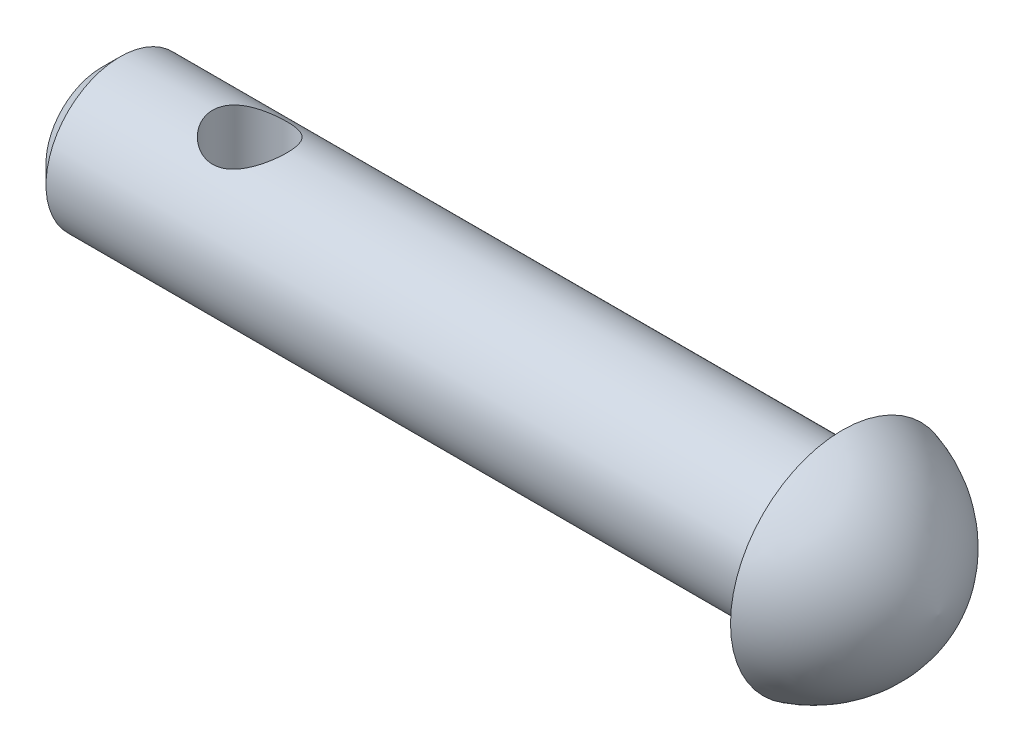
ISO-10303-21;
HEADER;
FILE_DESCRIPTION(('STEP AP214'),'2;1');
FILE_NAME('part.step','',(''),(''),'','','');
FILE_SCHEMA(('AUTOMOTIVE_DESIGN { 1 0 10303 214 1 1 1 1 }'));
ENDSEC;
DATA;
#1=APPLICATION_CONTEXT('core data for automotive mechanical design processes');
#2=APPLICATION_PROTOCOL_DEFINITION('international standard','automotive_design',2000,#1);
#3=PRODUCT_CONTEXT('',#1,'mechanical');
#4=PRODUCT('Part','Part','',(#3));
#5=PRODUCT_RELATED_PRODUCT_CATEGORY('part','',(#4));
#6=PRODUCT_DEFINITION_FORMATION('','',#4);
#7=PRODUCT_DEFINITION_CONTEXT('part definition',#1,'design');
#8=PRODUCT_DEFINITION('design','',#6,#7);
#9=PRODUCT_DEFINITION_SHAPE('','',#8);
#10=(LENGTH_UNIT() NAMED_UNIT(*) SI_UNIT(.MILLI.,.METRE.));
#11=(NAMED_UNIT(*) PLANE_ANGLE_UNIT() SI_UNIT($,.RADIAN.));
#12=(NAMED_UNIT(*) SI_UNIT($,.STERADIAN.) SOLID_ANGLE_UNIT());
#13=UNCERTAINTY_MEASURE_WITH_UNIT(LENGTH_MEASURE(1.E-05),#10,'distance_accuracy_value','');
#14=(GEOMETRIC_REPRESENTATION_CONTEXT(3) GLOBAL_UNCERTAINTY_ASSIGNED_CONTEXT((#13)) GLOBAL_UNIT_ASSIGNED_CONTEXT((#10,
#11,#12)) REPRESENTATION_CONTEXT('',''));
#15=CARTESIAN_POINT('',(0.,0.,0.));
#16=DIRECTION('',(0.,0.,1.));
#17=DIRECTION('',(1.,0.,0.));
#18=AXIS2_PLACEMENT_3D('',#15,#16,#17);
#19=CARTESIAN_POINT('',(20.,0.,0.));
#20=DIRECTION('',(-1.,0.,0.));
#21=DIRECTION('',(0.,0.,1.));
#22=AXIS2_PLACEMENT_3D('',#19,#20,#21);
#23=CYLINDRICAL_SURFACE('',#22,2.);
#24=CARTESIAN_POINT('',(3.,-2.,0.));
#25=CARTESIAN_POINT('',(3.0000033023195,-1.99999713404151,0.0525719629529864));
#26=CARTESIAN_POINT('',(3.00417007312168,-1.99790491019517,0.105206599698032));
#27=CARTESIAN_POINT('',(3.02065288034092,-1.98974156037396,0.208920235268425));
#28=CARTESIAN_POINT('',(3.03298439299765,-1.98366287828983,0.259996086713504));
#29=CARTESIAN_POINT('',(3.06519380861679,-1.96816279403311,0.358933544880574));
#30=CARTESIAN_POINT('',(3.08504238424801,-1.9587543917752,0.40680680293918));
#31=CARTESIAN_POINT('',(3.13157062136494,-1.93745776515778,0.498472616806565));
#32=CARTESIAN_POINT('',(3.15824974424885,-1.9255697363353,0.54226549399005));
#33=CARTESIAN_POINT('',(3.2195172494853,-1.89956258258057,0.627507817761919));
#34=CARTESIAN_POINT('',(3.25448647923964,-1.88535199127536,0.668655211122112));
#35=CARTESIAN_POINT('',(3.33052147924703,-1.85659970246744,0.744779444866977));
#36=CARTESIAN_POINT('',(3.37159185177244,-1.84205776209035,0.779751583106766));
#37=CARTESIAN_POINT('',(3.46248334952338,-1.81298951197347,0.845252000450278));
#38=CARTESIAN_POINT('',(3.51273609834591,-1.79855186970132,0.875225335551637));
#39=CARTESIAN_POINT('',(3.61836733598621,-1.7728597877232,0.926168226890695));
#40=CARTESIAN_POINT('',(3.67374212872275,-1.76160307606989,0.947144214966333));
#41=CARTESIAN_POINT('',(3.78466510542192,-1.74457867037808,0.978132442188588));
#42=CARTESIAN_POINT('',(3.84000445206739,-1.73852271583713,0.988725857080441));
#43=CARTESIAN_POINT('',(3.95197883777948,-1.73181889948527,1.00042699330885));
#44=CARTESIAN_POINT('',(4.00861254087116,-1.73116569343288,1.00154408837307));
#45=CARTESIAN_POINT('',(4.11428602431537,-1.73510930257248,0.994687287172294));
#46=CARTESIAN_POINT('',(4.16342403122305,-1.73908763662013,0.987784559536821));
#47=CARTESIAN_POINT('',(4.25972190937304,-1.7507622873385,0.966939849056932));
#48=CARTESIAN_POINT('',(4.30688114530532,-1.75845978831776,0.952995623897651));
#49=CARTESIAN_POINT('',(4.39922913256566,-1.77687476412741,0.918209780386003));
#50=CARTESIAN_POINT('',(4.44434639878579,-1.78765840663998,0.897215067115994));
#51=CARTESIAN_POINT('',(4.53063429259001,-1.81103404281403,0.849041687668002));
#52=CARTESIAN_POINT('',(4.57180313560009,-1.8236268478019,0.821860243812467));
#53=CARTESIAN_POINT('',(4.65452125274323,-1.85113157903286,0.758066054912788));
#54=CARTESIAN_POINT('',(4.69545687357616,-1.86613510236746,0.720694458369281));
#55=CARTESIAN_POINT('',(4.7707354185909,-1.89547623300407,0.639555578741373));
#56=CARTESIAN_POINT('',(4.80507519203388,-1.90981351958801,0.595785256574285));
#57=CARTESIAN_POINT('',(4.86768566102973,-1.93701987282964,0.500516505831848));
#58=CARTESIAN_POINT('',(4.89560047244574,-1.94978984162007,0.448753591599408));
#59=CARTESIAN_POINT('',(4.94209702904301,-1.97157881121242,0.340466215488797));
#60=CARTESIAN_POINT('',(4.96068618501517,-1.98060078943552,0.283945576265277));
#61=CARTESIAN_POINT('',(4.98647540371668,-1.99324333741436,0.172766491660702));
#62=CARTESIAN_POINT('',(4.99449123574678,-1.99724938301311,0.118341530548325));
#63=CARTESIAN_POINT('',(5.00146473113449,-2.00073013459102,0.00877959994935379));
#64=CARTESIAN_POINT('',(5.00042668563948,-2.00020698721312,-0.0463570198699013));
#65=CARTESIAN_POINT('',(4.98979331158125,-1.99491192253441,-0.151232971985994));
#66=CARTESIAN_POINT('',(4.98086746726997,-1.99047245688189,-0.201059408049954));
#67=CARTESIAN_POINT('',(4.95576192810491,-1.97822171314819,-0.298406892301917));
#68=CARTESIAN_POINT('',(4.93958143354664,-1.97041006334332,-0.345927685690997));
#69=CARTESIAN_POINT('',(4.90000153356683,-1.95184251413669,-0.438888608449665));
#70=CARTESIAN_POINT('',(4.87640894988319,-1.94100881769939,-0.484230397006153));
#71=CARTESIAN_POINT('',(4.82289246435396,-1.91743974317109,-0.570461361698921));
#72=CARTESIAN_POINT('',(4.79296586540657,-1.90470355565785,-0.611348629775282));
#73=CARTESIAN_POINT('',(4.72423957466713,-1.87708221337464,-0.691767689290653));
#74=CARTESIAN_POINT('',(4.68485713154644,-1.86210884848441,-0.730772077824638));
#75=CARTESIAN_POINT('',(4.6000748487307,-1.83262391603874,-0.801856321113239));
#76=CARTESIAN_POINT('',(4.55467088118363,-1.81811267381526,-0.833931385690841));
#77=CARTESIAN_POINT('',(4.45635634579969,-1.79051192226068,-0.891707914497695));
#78=CARTESIAN_POINT('',(4.40318873379141,-1.77752529663472,-0.917025495878637));
#79=CARTESIAN_POINT('',(4.29248993230748,-1.75574072368126,-0.958082826013803));
#80=CARTESIAN_POINT('',(4.23496447349881,-1.74693738240618,-0.97383491588757));
#81=CARTESIAN_POINT('',(4.12308977713855,-1.73561501008667,-0.993861687449679));
#82=CARTESIAN_POINT('',(4.06896574657096,-1.73257383460491,-0.999092996400865));
#83=CARTESIAN_POINT('',(3.96055293282927,-1.73165354646175,-1.00068915438079));
#84=CARTESIAN_POINT('',(3.90626423126057,-1.73377219627552,-0.997057846624399));
#85=CARTESIAN_POINT('',(3.80451649846798,-1.74237862050024,-0.981926125592263));
#86=CARTESIAN_POINT('',(3.7568995298556,-1.74843094482393,-0.971208314342799));
#87=CARTESIAN_POINT('',(3.66419188057529,-1.76371016187917,-0.943175358224645));
#88=CARTESIAN_POINT('',(3.61910201790803,-1.77293807569675,-0.92585809115981));
#89=CARTESIAN_POINT('',(3.52937514901339,-1.79428530364528,-0.883815745300683));
#90=CARTESIAN_POINT('',(3.4849720981703,-1.8065572239619,-0.858671137816458));
#91=CARTESIAN_POINT('',(3.40072546381941,-1.8323533163459,-0.802150971636634));
#92=CARTESIAN_POINT('',(3.36088426948151,-1.84587813794522,-0.770772171238648));
#93=CARTESIAN_POINT('',(3.28185801764238,-1.87462323159313,-0.698203326664641));
#94=CARTESIAN_POINT('',(3.24334089763808,-1.88984983311468,-0.656284423010171));
#95=CARTESIAN_POINT('',(3.17373701657637,-1.91877752255087,-0.56615480622028));
#96=CARTESIAN_POINT('',(3.14265426057371,-1.9324777860804,-0.517940723256785));
#97=CARTESIAN_POINT('',(3.0887636372378,-1.95698009585103,-0.415931596819947));
#98=CARTESIAN_POINT('',(3.06601583058857,-1.96776096562909,-0.362099503934614));
#99=CARTESIAN_POINT('',(3.03019183208105,-1.98501341363465,-0.250742101294191));
#100=CARTESIAN_POINT('',(3.01708815317042,-1.99149723372932,-0.193227799623166));
#101=CARTESIAN_POINT('',(3.00610258892415,-1.99695461909663,-0.112601946483384));
#102=CARTESIAN_POINT('',(3.00381735913638,-1.99809365339201,-0.0901618794394987));
#103=CARTESIAN_POINT('',(3.00076533448319,-1.99961696977865,-0.0451517318071577));
#104=CARTESIAN_POINT('',(2.9999985815288,-2.00000123103763,-0.0225816476473814));
#105=CARTESIAN_POINT('',(3.,-2.,0.));
#106=B_SPLINE_CURVE_WITH_KNOTS('',3,(#24,#25,#26,#27,#28,#29,#30,#31,#32,#33,#34,#35,#36,#37,
#38,#39,#40,#41,#42,#43,#44,#45,#46,#47,#48,#49,#50,#51,#52,#53,#54,#55,#56,#57,#58,#59,#60,#61,
#62,#63,#64,#65,#66,#67,#68,#69,#70,#71,#72,#73,#74,#75,#76,#77,#78,#79,#80,#81,#82,#83,#84,#85,
#86,#87,#88,#89,#90,#91,#92,#93,#94,#95,#96,#97,#98,#99,#100,#101,#102,#103,#104,#105),
.UNSPECIFIED.,.T.,.F.,(4,2,2,2,2,2,2,2,2,2,2,2,2,2,2,2,2,2,2,2,2,2,2,2,2,2,2,2,2,2,2,2,2,2,2,2,
2,2,2,2,4),(0.,0.157624257420292,0.315548149709198,0.472862155492298,0.630163760581568,
0.796981758718088,0.963926237654035,1.14381726430753,1.32357947898281,1.49258012140229,
1.6614135732902,1.81005712409321,1.95874803925678,2.11090240168487,2.26312521260222,
2.43464941333878,2.60625534598686,2.78583022214441,2.96526216912279,3.12983290471346,
3.29432564511476,3.44606906506122,3.59782921630931,3.75392856027899,3.91009450748339,
4.08159610644419,4.25321588615432,4.43314682159674,4.61284511940778,4.77529307498373,
4.93767059860005,5.08457930244183,5.23153528783678,5.38836456775614,5.54527561138958,
5.72125242752498,5.89732383376572,6.07464013662925,6.2514490862493,6.31915280137697,
6.38685838514847),.UNSPECIFIED.);
#107=CARTESIAN_POINT('',(3.,-2.,0.));
#108=VERTEX_POINT('',#107);
#109=EDGE_CURVE('E11',#108,#108,#106,.T.);
#110=ORIENTED_EDGE('',*,*,#109,.T.);
#111=EDGE_LOOP('',(#110));
#112=FACE_BOUND('',#111,.T.);
#113=CARTESIAN_POINT('',(4.,1.73205080756888,1.));
#114=CARTESIAN_POINT('',(3.94789219180475,1.73205534728459,0.999996363074531));
#115=CARTESIAN_POINT('',(3.89571858847495,1.73443801187756,0.995899970733216));
#116=CARTESIAN_POINT('',(3.79297273532285,1.74362366452052,0.979723209898053));
#117=CARTESIAN_POINT('',(3.74240408495659,1.75043594055559,0.967626064554179));
#118=CARTESIAN_POINT('',(3.64454833565606,1.76749346605398,0.936099948699812));
#119=CARTESIAN_POINT('',(3.59724534752641,1.77772043473252,0.916709952493731));
#120=CARTESIAN_POINT('',(3.50657579800328,1.80042664816858,0.871267525376372));
#121=CARTESIAN_POINT('',(3.46320944973754,1.81290601476064,0.845214734035773));
#122=CARTESIAN_POINT('',(3.37769427144249,1.83996869057441,0.784666540530879));
#123=CARTESIAN_POINT('',(3.33594086432646,1.85464063637953,0.74965203614377));
#124=CARTESIAN_POINT('',(3.25859161159329,1.88371982785706,0.673253807614468));
#125=CARTESIAN_POINT('',(3.22299883741648,1.8981269383125,0.631866925782293));
#126=CARTESIAN_POINT('',(3.15663284885234,1.92621476952949,0.540489563414546));
#127=CARTESIAN_POINT('',(3.12634623214047,1.93978106418172,0.490107189012575));
#128=CARTESIAN_POINT('',(3.07485914675424,1.96350756099529,0.384157026599504));
#129=CARTESIAN_POINT('',(3.05365294386283,1.97366991183741,0.328592538138155));
#130=CARTESIAN_POINT('',(3.0224953386989,1.98880461244237,0.218044943925977));
#131=CARTESIAN_POINT('',(3.01185047364447,1.99409480220892,0.163301790488818));
#132=CARTESIAN_POINT('',(2.99983388132496,2.00007583846067,0.0525706286978481));
#133=CARTESIAN_POINT('',(2.99845654320429,2.0007694678459,-0.00341660584373856));
#134=CARTESIAN_POINT('',(3.00474667397035,1.9976298191645,-0.10983252442375));
#135=CARTESIAN_POINT('',(3.01163801552122,1.9941849589216,-0.160321199176791));
#136=CARTESIAN_POINT('',(3.03288084390466,1.98374245259747,-0.259313771918322));
#137=CARTESIAN_POINT('',(3.04723288897622,1.97674454066394,-0.307817521093925));
#138=CARTESIAN_POINT('',(3.08308256608981,1.95971583287654,-0.402309391569553));
#139=CARTESIAN_POINT('',(3.10467631317207,1.94964441529199,-0.448253423515178));
#140=CARTESIAN_POINT('',(3.15426341620149,1.92737645986687,-0.535976801513328));
#141=CARTESIAN_POINT('',(3.18225906330235,1.91517916157484,-0.577754648838645));
#142=CARTESIAN_POINT('',(3.24689535153302,1.88844394399229,-0.660173660898195));
#143=CARTESIAN_POINT('',(3.28410302832601,1.87379375998175,-0.70033407502936));
#144=CARTESIAN_POINT('',(3.36458972493018,1.84454340586811,-0.77410437029778));
#145=CARTESIAN_POINT('',(3.40787337227406,1.82994328265629,-0.80770921157423));
#146=CARTESIAN_POINT('',(3.50264819242409,1.80144156092484,-0.869505334642211));
#147=CARTESIAN_POINT('',(3.55448602305421,1.78764319990707,-0.897217314978051));
#148=CARTESIAN_POINT('',(3.662937671359,1.76375450278576,-0.943319113001231));
#149=CARTESIAN_POINT('',(3.71954643301756,1.75366030046067,-0.961718658210889));
#150=CARTESIAN_POINT('',(3.83121451128279,1.73944635817034,-0.98718021102504));
#151=CARTESIAN_POINT('',(3.88604111904355,1.73491655848496,-0.995025122119975));
#152=CARTESIAN_POINT('',(3.99640134151654,1.73117919361609,-1.00151694661143));
#153=CARTESIAN_POINT('',(4.05193442911979,1.73196786889311,-1.00017035731503));
#154=CARTESIAN_POINT('',(4.15565391857873,1.73834336540585,-0.989036043343966));
#155=CARTESIAN_POINT('',(4.20397945110793,1.74339587506654,-0.980187816712467));
#156=CARTESIAN_POINT('',(4.29836778627096,1.75694021551341,-0.955696284632441));
#157=CARTESIAN_POINT('',(4.34442985074661,1.76543316005034,-0.940050778623614));
#158=CARTESIAN_POINT('',(4.43541133090269,1.78536222079656,-0.901647588604886));
#159=CARTESIAN_POINT('',(4.48017901685355,1.79691643243063,-0.878594063692723));
#160=CARTESIAN_POINT('',(4.56546927153899,1.82156119497249,-0.826287064015804));
#161=CARTESIAN_POINT('',(4.60598964351328,1.83465253355147,-0.797030404332216));
#162=CARTESIAN_POINT('',(4.68697876752355,1.86287998456336,-0.728837167198853));
#163=CARTESIAN_POINT('',(4.72679715071766,1.87806583154289,-0.689145272314967));
#164=CARTESIAN_POINT('',(4.79941223799359,1.90734234977892,-0.603404495398289));
#165=CARTESIAN_POINT('',(4.83220657023054,1.92143265007709,-0.557353474655347));
#166=CARTESIAN_POINT('',(4.8905737259501,1.94741361690957,-0.458535362558757));
#167=CARTESIAN_POINT('',(4.91593311821091,1.95923641672029,-0.405623097574113));
#168=CARTESIAN_POINT('',(4.95713790385739,1.97883354959301,-0.295522364641082));
#169=CARTESIAN_POINT('',(4.97299165136631,1.98661143676373,-0.238337701392176));
#170=CARTESIAN_POINT('',(4.99336856417466,1.99667508181883,-0.126979682330417));
#171=CARTESIAN_POINT('',(4.99879787587611,1.99939927908191,-0.0730114438504565));
#172=CARTESIAN_POINT('',(5.0008432654544,2.00042130375131,0.0351259859512038));
#173=CARTESIAN_POINT('',(4.99746242852356,1.9987206806689,0.0892951002950867));
#174=CARTESIAN_POINT('',(4.98258359320438,1.99133968837922,0.192537992317147));
#175=CARTESIAN_POINT('',(4.97163515074233,1.9859289466799,0.241712317811264));
#176=CARTESIAN_POINT('',(4.94267300069703,1.97192093663423,0.337445952183617));
#177=CARTESIAN_POINT('',(4.92465827990655,1.96332321132796,0.384004884955508));
#178=CARTESIAN_POINT('',(4.88127294783403,1.9432593074812,0.475423406244884));
#179=CARTESIAN_POINT('',(4.85562067679216,1.93168617198799,0.520125142700046));
#180=CARTESIAN_POINT('',(4.79804206914095,1.90688133141826,0.604774641814024));
#181=CARTESIAN_POINT('',(4.76611285088433,1.8936488655836,0.644720207414907));
#182=CARTESIAN_POINT('',(4.6932028609773,1.86528610226627,0.722914004156891));
#183=CARTESIAN_POINT('',(4.65163751252281,1.85009799011698,0.760597684539271));
#184=CARTESIAN_POINT('',(4.56254927887023,1.82063076162852,0.828663287394675));
#185=CARTESIAN_POINT('',(4.51502117913232,1.80635245761865,0.859038750010058));
#186=CARTESIAN_POINT('',(4.41336335341905,1.77999605304916,0.912431079785654));
#187=CARTESIAN_POINT('',(4.35907246887126,1.7680017425627,0.935185065960939));
#188=CARTESIAN_POINT('',(4.24666759566022,1.74866156328351,0.970878709506411));
#189=CARTESIAN_POINT('',(4.18856711108731,1.74130016147702,0.983851191175346));
#190=CARTESIAN_POINT('',(4.108194644348,1.7352927260179,0.994367007864414));
#191=CARTESIAN_POINT('',(4.08663210560212,1.73408129005152,0.996476104963851));
#192=CARTESIAN_POINT('',(4.04338351931776,1.7324593588775,0.999293405089963));
#193=CARTESIAN_POINT('',(4.02169746361413,1.73204891725109,1.00000151439987));
#194=CARTESIAN_POINT('',(4.,1.73205080756888,1.));
#195=B_SPLINE_CURVE_WITH_KNOTS('',3,(#113,#114,#115,#116,#117,#118,#119,#120,#121,#122,#123,
#124,#125,#126,#127,#128,#129,#130,#131,#132,#133,#134,#135,#136,#137,#138,#139,#140,#141,#142,
#143,#144,#145,#146,#147,#148,#149,#150,#151,#152,#153,#154,#155,#156,#157,#158,#159,#160,#161,
#162,#163,#164,#165,#166,#167,#168,#169,#170,#171,#172,#173,#174,#175,#176,#177,#178,#179,#180,
#181,#182,#183,#184,#185,#186,#187,#188,#189,#190,#191,#192,#193,#194),.UNSPECIFIED.,.T.,.F.,(4,
2,2,2,2,2,2,2,2,2,2,2,2,2,2,2,2,2,2,2,2,2,2,2,2,2,2,2,2,2,2,2,2,2,2,2,2,2,2,2,4),(0.,
0.156232122594716,0.312792892824805,0.468528595918885,0.624272725445149,0.792862312498234,
0.96153571084371,1.14157892238763,1.32150826963891,1.48863484967935,1.6556602368604,
1.80816097484538,1.96067312517455,2.11529534731147,2.26997299350272,2.43927191456891,
2.60870048245918,2.78888841729448,2.96888774211705,3.13462290854212,3.30024093188373,
3.44774183424025,3.59529052436063,3.74967296406088,3.90413486220047,4.07806743580613,
4.25205864978202,4.43064181412966,4.60906779808771,4.77112270389487,4.93312086793971,
5.08444424871492,5.23578933512013,5.39360750719472,5.55149830100719,5.72510241850067,
5.89885942845154,6.07810749038605,6.2567513300276,6.32180135185309,6.3868557249454),.UNSPECIFIED.);
#196=CARTESIAN_POINT('',(4.,1.73205080756888,1.));
#197=VERTEX_POINT('',#196);
#198=EDGE_CURVE('E56',#197,#197,#195,.T.);
#199=ORIENTED_EDGE('',*,*,#198,.T.);
#200=EDGE_LOOP('',(#199));
#201=FACE_BOUND('',#200,.T.);
#202=CARTESIAN_POINT('',(0.499999999999997,0.,0.));
#203=DIRECTION('',(1.,0.,0.));
#204=DIRECTION('',(0.,0.,-1.));
#205=AXIS2_PLACEMENT_3D('',#202,#203,#204);
#206=CIRCLE('',#205,2.);
#207=CARTESIAN_POINT('',(0.499999999999997,0.,-2.));
#208=VERTEX_POINT('',#207);
#209=EDGE_CURVE('E96',#208,#208,#206,.T.);
#210=ORIENTED_EDGE('',*,*,#209,.T.);
#211=EDGE_LOOP('',(#210));
#212=FACE_BOUND('',#211,.T.);
#213=CARTESIAN_POINT('',(20.,0.,0.));
#214=DIRECTION('',(1.,0.,0.));
#215=DIRECTION('',(0.,0.,-1.));
#216=AXIS2_PLACEMENT_3D('',#213,#214,#215);
#217=CIRCLE('',#216,2.);
#218=CARTESIAN_POINT('',(20.,0.,-2.));
#219=VERTEX_POINT('',#218);
#220=EDGE_CURVE('E100',#219,#219,#217,.T.);
#221=ORIENTED_EDGE('',*,*,#220,.F.);
#222=EDGE_LOOP('',(#221));
#223=FACE_BOUND('',#222,.T.);
#224=ADVANCED_FACE('F43',(#112,#201,#212,#223),#23,.T.);
#225=CARTESIAN_POINT('',(0.,0.,0.));
#226=DIRECTION('',(1.,0.,0.));
#227=DIRECTION('',(0.,0.,-1.));
#228=AXIS2_PLACEMENT_3D('',#225,#226,#227);
#229=PLANE('',#228);
#230=CARTESIAN_POINT('',(0.,0.,0.));
#231=DIRECTION('',(1.,0.,0.));
#232=DIRECTION('',(0.,0.,-1.));
#233=AXIS2_PLACEMENT_3D('',#230,#231,#232);
#234=CIRCLE('',#233,1.5);
#235=CARTESIAN_POINT('',(0.,0.,-1.5));
#236=VERTEX_POINT('',#235);
#237=EDGE_CURVE('E90',#236,#236,#234,.F.);
#238=ORIENTED_EDGE('',*,*,#237,.T.);
#239=EDGE_LOOP('',(#238));
#240=FACE_BOUND('',#239,.T.);
#241=ADVANCED_FACE('F74',(#240),#229,.F.);
#242=CARTESIAN_POINT('',(0.499999999999997,0.,0.));
#243=DIRECTION('',(1.,0.,0.));
#244=DIRECTION('',(0.,0.,-1.));
#245=AXIS2_PLACEMENT_3D('',#242,#243,#244);
#246=CONICAL_SURFACE('',#245,2.,0.785398163397452);
#247=ORIENTED_EDGE('',*,*,#237,.F.);
#248=EDGE_LOOP('',(#247));
#249=FACE_BOUND('',#248,.T.);
#250=ORIENTED_EDGE('',*,*,#209,.F.);
#251=EDGE_LOOP('',(#250));
#252=FACE_BOUND('',#251,.T.);
#253=ADVANCED_FACE('F46',(#249,#252),#246,.T.);
#254=CARTESIAN_POINT('',(4.,-2.,0.));
#255=DIRECTION('',(0.,1.,0.));
#256=DIRECTION('',(0.,0.,1.));
#257=AXIS2_PLACEMENT_3D('',#254,#255,#256);
#258=CYLINDRICAL_SURFACE('',#257,1.);
#259=ORIENTED_EDGE('',*,*,#198,.F.);
#260=EDGE_LOOP('',(#259));
#261=FACE_BOUND('',#260,.T.);
#262=ORIENTED_EDGE('',*,*,#109,.F.);
#263=EDGE_LOOP('',(#262));
#264=FACE_BOUND('',#263,.T.);
#265=ADVANCED_FACE('F62',(#261,#264),#258,.F.);
#266=CARTESIAN_POINT('',(19.0281520544688,0.,-0.449335346934585));
#267=DIRECTION('',(0.,-1.,0.));
#268=DIRECTION('',(0.,0.,1.));
#269=AXIS2_PLACEMENT_3D('',#266,#267,#268);
#270=CIRCLE('',#269,3.6);
#271=TRIMMED_CURVE('',#270,(PARAMETER_VALUE(-1.44565457881373)),
(PARAMETER_VALUE(1.44565457881373)),.T.,.PARAMETER.);
#272=CARTESIAN_POINT('',(19.0281520544688,0.,0.));
#273=DIRECTION('',(-1.,0.,0.));
#274=AXIS1_PLACEMENT('',#272,#273);
#275=SURFACE_OF_REVOLUTION('',#271,#274);
#276=CARTESIAN_POINT('',(20.,0.,0.));
#277=DIRECTION('',(-1.,0.,0.));
#278=DIRECTION('',(0.,0.,1.));
#279=AXIS2_PLACEMENT_3D('',#276,#277,#278);
#280=CIRCLE('',#279,3.01700444754126);
#281=CARTESIAN_POINT('',(20.,0.,3.01700444754126));
#282=VERTEX_POINT('',#281);
#283=EDGE_CURVE('E104',#282,#282,#280,.T.);
#284=ORIENTED_EDGE('',*,*,#283,.F.);
#285=EDGE_LOOP('',(#284));
#286=FACE_BOUND('',#285,.T.);
#287=CARTESIAN_POINT('',(22.6,0.,0.));
#288=VERTEX_POINT('',#287);
#289=VERTEX_LOOP('',#288);
#290=FACE_BOUND('',#289,.T.);
#291=ADVANCED_FACE('F59',(#286,#290),#275,.T.);
#292=CARTESIAN_POINT('',(20.,3.01700444754126,0.));
#293=DIRECTION('',(1.,0.,0.));
#294=DIRECTION('',(0.,0.,-1.));
#295=AXIS2_PLACEMENT_3D('',#292,#293,#294);
#296=PLANE('',#295);
#297=ORIENTED_EDGE('',*,*,#220,.T.);
#298=EDGE_LOOP('',(#297));
#299=FACE_BOUND('',#298,.T.);
#300=ORIENTED_EDGE('',*,*,#283,.T.);
#301=EDGE_LOOP('',(#300));
#302=FACE_BOUND('',#301,.T.);
#303=ADVANCED_FACE('F61',(#299,#302),#296,.F.);
#304=CLOSED_SHELL('',(#224,#241,#253,#265,#291,#303));
#305=MANIFOLD_SOLID_BREP('B2',#304);
#306=ADVANCED_BREP_SHAPE_REPRESENTATION('',(#18,#305),#14);
#307=SHAPE_DEFINITION_REPRESENTATION(#9,#306);
ENDSEC;
END-ISO-10303-21;
